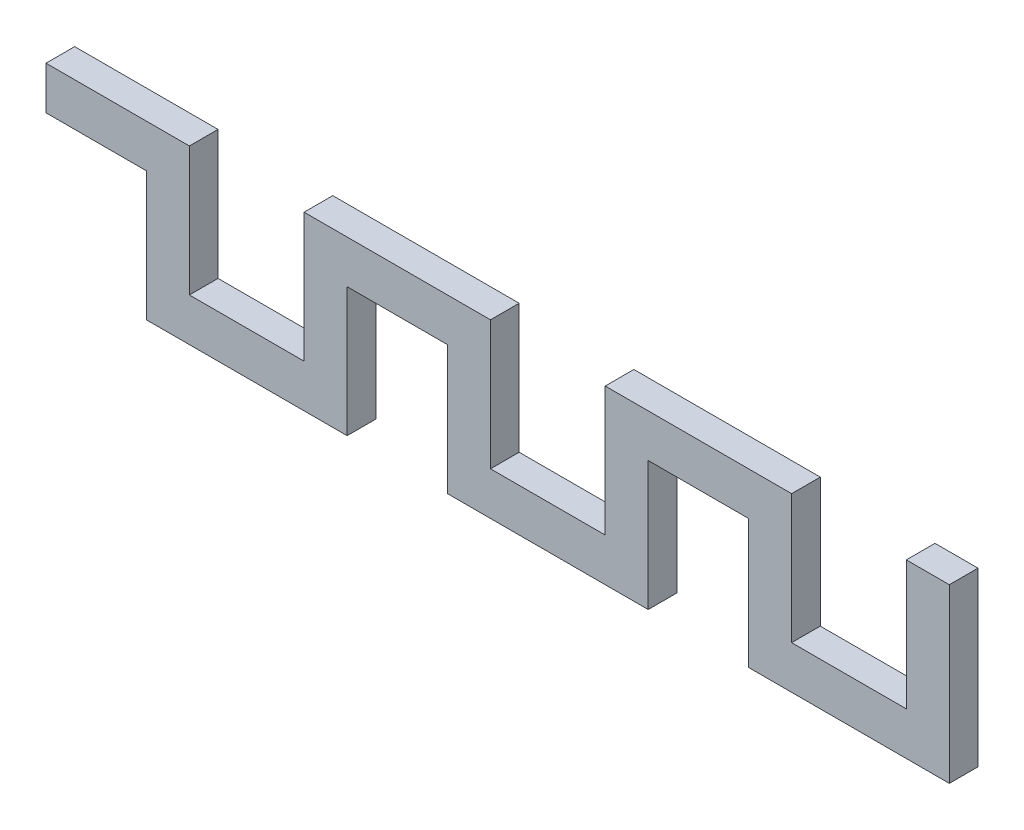
ISO-10303-21;
HEADER;
FILE_DESCRIPTION(('STEP AP214'),'2;1');
FILE_NAME('part.step','',(''),(''),'','','');
FILE_SCHEMA(('AUTOMOTIVE_DESIGN { 1 0 10303 214 1 1 1 1 }'));
ENDSEC;
DATA;
#1=APPLICATION_CONTEXT('core data for automotive mechanical design processes');
#2=APPLICATION_PROTOCOL_DEFINITION('international standard','automotive_design',2000,#1);
#3=PRODUCT_CONTEXT('',#1,'mechanical');
#4=PRODUCT('Part','Part','',(#3));
#5=PRODUCT_RELATED_PRODUCT_CATEGORY('part','',(#4));
#6=PRODUCT_DEFINITION_FORMATION('','',#4);
#7=PRODUCT_DEFINITION_CONTEXT('part definition',#1,'design');
#8=PRODUCT_DEFINITION('design','',#6,#7);
#9=PRODUCT_DEFINITION_SHAPE('','',#8);
#10=(LENGTH_UNIT() NAMED_UNIT(*) SI_UNIT(.MILLI.,.METRE.));
#11=(NAMED_UNIT(*) PLANE_ANGLE_UNIT() SI_UNIT($,.RADIAN.));
#12=(NAMED_UNIT(*) SI_UNIT($,.STERADIAN.) SOLID_ANGLE_UNIT());
#13=UNCERTAINTY_MEASURE_WITH_UNIT(LENGTH_MEASURE(1.E-05),#10,'distance_accuracy_value','');
#14=(GEOMETRIC_REPRESENTATION_CONTEXT(3) GLOBAL_UNCERTAINTY_ASSIGNED_CONTEXT((#13)) GLOBAL_UNIT_ASSIGNED_CONTEXT((#10,
#11,#12)) REPRESENTATION_CONTEXT('',''));
#15=CARTESIAN_POINT('',(0.,0.,0.));
#16=DIRECTION('',(0.,0.,1.));
#17=DIRECTION('',(1.,0.,0.));
#18=AXIS2_PLACEMENT_3D('',#15,#16,#17);
#19=CARTESIAN_POINT('',(0.,0.,4.));
#20=DIRECTION('',(1.,0.,0.));
#21=DIRECTION('',(0.,0.,-1.));
#22=AXIS2_PLACEMENT_3D('',#19,#20,#21);
#23=PLANE('',#22);
#24=DIRECTION('',(0.,-1.,0.));
#25=VECTOR('',#24,1.);
#26=CARTESIAN_POINT('',(0.,0.,0.));
#27=LINE('',#26,#25);
#28=CARTESIAN_POINT('',(0.,0.,0.));
#29=VERTEX_POINT('',#28);
#30=CARTESIAN_POINT('',(0.,-6.,0.));
#31=VERTEX_POINT('',#30);
#32=EDGE_CURVE('E248',#29,#31,#27,.T.);
#33=ORIENTED_EDGE('',*,*,#32,.T.);
#34=DIRECTION('',(0.,0.,-1.));
#35=VECTOR('',#34,1.);
#36=CARTESIAN_POINT('',(0.,-6.,4.));
#37=LINE('',#36,#35);
#38=CARTESIAN_POINT('',(0.,-6.,4.));
#39=VERTEX_POINT('',#38);
#40=EDGE_CURVE('E11',#39,#31,#37,.T.);
#41=ORIENTED_EDGE('',*,*,#40,.F.);
#42=DIRECTION('',(0.,-1.,0.));
#43=VECTOR('',#42,1.);
#44=CARTESIAN_POINT('',(0.,0.,4.));
#45=LINE('',#44,#43);
#46=CARTESIAN_POINT('',(0.,0.,4.));
#47=VERTEX_POINT('',#46);
#48=EDGE_CURVE('E299',#47,#39,#45,.T.);
#49=ORIENTED_EDGE('',*,*,#48,.F.);
#50=DIRECTION('',(0.,0.,-1.));
#51=VECTOR('',#50,1.);
#52=CARTESIAN_POINT('',(0.,0.,4.));
#53=LINE('',#52,#51);
#54=EDGE_CURVE('E244',#47,#29,#53,.T.);
#55=ORIENTED_EDGE('',*,*,#54,.T.);
#56=EDGE_LOOP('',(#33,#41,#49,#55));
#57=FACE_BOUND('',#56,.T.);
#58=ADVANCED_FACE('F43',(#57),#23,.F.);
#59=CARTESIAN_POINT('',(0.,-6.,4.));
#60=DIRECTION('',(0.,1.,0.));
#61=DIRECTION('',(0.,0.,1.));
#62=AXIS2_PLACEMENT_3D('',#59,#60,#61);
#63=PLANE('',#62);
#64=DIRECTION('',(1.,0.,0.));
#65=VECTOR('',#64,1.);
#66=CARTESIAN_POINT('',(0.,-6.,0.));
#67=LINE('',#66,#65);
#68=CARTESIAN_POINT('',(14.,-6.,0.));
#69=VERTEX_POINT('',#68);
#70=EDGE_CURVE('E251',#31,#69,#67,.T.);
#71=ORIENTED_EDGE('',*,*,#70,.T.);
#72=DIRECTION('',(0.,0.,-1.));
#73=VECTOR('',#72,1.);
#74=CARTESIAN_POINT('',(14.,-6.,4.));
#75=LINE('',#74,#73);
#76=CARTESIAN_POINT('',(14.,-6.,4.));
#77=VERTEX_POINT('',#76);
#78=EDGE_CURVE('E52',#77,#69,#75,.T.);
#79=ORIENTED_EDGE('',*,*,#78,.F.);
#80=DIRECTION('',(1.,0.,0.));
#81=VECTOR('',#80,1.);
#82=CARTESIAN_POINT('',(0.,-6.,4.));
#83=LINE('',#82,#81);
#84=EDGE_CURVE('E157',#39,#77,#83,.T.);
#85=ORIENTED_EDGE('',*,*,#84,.F.);
#86=ORIENTED_EDGE('',*,*,#40,.T.);
#87=EDGE_LOOP('',(#71,#79,#85,#86));
#88=FACE_BOUND('',#87,.T.);
#89=ADVANCED_FACE('F447',(#88),#63,.F.);
#90=CARTESIAN_POINT('',(14.,-6.,4.));
#91=DIRECTION('',(1.,0.,0.));
#92=DIRECTION('',(0.,0.,-1.));
#93=AXIS2_PLACEMENT_3D('',#90,#91,#92);
#94=PLANE('',#93);
#95=DIRECTION('',(0.,-1.,0.));
#96=VECTOR('',#95,1.);
#97=CARTESIAN_POINT('',(14.,-6.,0.));
#98=LINE('',#97,#96);
#99=CARTESIAN_POINT('',(14.,-24.,0.));
#100=VERTEX_POINT('',#99);
#101=EDGE_CURVE('E253',#69,#100,#98,.T.);
#102=ORIENTED_EDGE('',*,*,#101,.T.);
#103=DIRECTION('',(0.,0.,-1.));
#104=VECTOR('',#103,1.);
#105=CARTESIAN_POINT('',(14.,-24.,4.));
#106=LINE('',#105,#104);
#107=CARTESIAN_POINT('',(14.,-24.,4.));
#108=VERTEX_POINT('',#107);
#109=EDGE_CURVE('E360',#108,#100,#106,.T.);
#110=ORIENTED_EDGE('',*,*,#109,.F.);
#111=DIRECTION('',(0.,-1.,0.));
#112=VECTOR('',#111,1.);
#113=CARTESIAN_POINT('',(14.,-6.,4.));
#114=LINE('',#113,#112);
#115=EDGE_CURVE('E368',#77,#108,#114,.T.);
#116=ORIENTED_EDGE('',*,*,#115,.F.);
#117=ORIENTED_EDGE('',*,*,#78,.T.);
#118=EDGE_LOOP('',(#102,#110,#116,#117));
#119=FACE_BOUND('',#118,.T.);
#120=ADVANCED_FACE('F366',(#119),#94,.F.);
#121=CARTESIAN_POINT('',(14.,-24.,4.));
#122=DIRECTION('',(0.,1.,0.));
#123=DIRECTION('',(0.,0.,1.));
#124=AXIS2_PLACEMENT_3D('',#121,#122,#123);
#125=PLANE('',#124);
#126=DIRECTION('',(1.,0.,0.));
#127=VECTOR('',#126,1.);
#128=CARTESIAN_POINT('',(14.,-24.,0.));
#129=LINE('',#128,#127);
#130=CARTESIAN_POINT('',(42.,-24.,0.));
#131=VERTEX_POINT('',#130);
#132=EDGE_CURVE('E255',#100,#131,#129,.T.);
#133=ORIENTED_EDGE('',*,*,#132,.T.);
#134=DIRECTION('',(0.,0.,-1.));
#135=VECTOR('',#134,1.);
#136=CARTESIAN_POINT('',(42.,-24.,4.));
#137=LINE('',#136,#135);
#138=CARTESIAN_POINT('',(42.,-24.,4.));
#139=VERTEX_POINT('',#138);
#140=EDGE_CURVE('E357',#139,#131,#137,.T.);
#141=ORIENTED_EDGE('',*,*,#140,.F.);
#142=DIRECTION('',(1.,0.,0.));
#143=VECTOR('',#142,1.);
#144=CARTESIAN_POINT('',(14.,-24.,4.));
#145=LINE('',#144,#143);
#146=EDGE_CURVE('E386',#108,#139,#145,.T.);
#147=ORIENTED_EDGE('',*,*,#146,.F.);
#148=ORIENTED_EDGE('',*,*,#109,.T.);
#149=EDGE_LOOP('',(#133,#141,#147,#148));
#150=FACE_BOUND('',#149,.T.);
#151=ADVANCED_FACE('F377',(#150),#125,.F.);
#152=CARTESIAN_POINT('',(42.,-24.,4.));
#153=DIRECTION('',(-1.,0.,0.));
#154=DIRECTION('',(0.,0.,1.));
#155=AXIS2_PLACEMENT_3D('',#152,#153,#154);
#156=PLANE('',#155);
#157=DIRECTION('',(0.,1.,0.));
#158=VECTOR('',#157,1.);
#159=CARTESIAN_POINT('',(42.,-24.,0.));
#160=LINE('',#159,#158);
#161=CARTESIAN_POINT('',(42.,-6.,0.));
#162=VERTEX_POINT('',#161);
#163=EDGE_CURVE('E257',#131,#162,#160,.T.);
#164=ORIENTED_EDGE('',*,*,#163,.T.);
#165=DIRECTION('',(0.,0.,-1.));
#166=VECTOR('',#165,1.);
#167=CARTESIAN_POINT('',(42.,-6.,4.));
#168=LINE('',#167,#166);
#169=CARTESIAN_POINT('',(42.,-6.,4.));
#170=VERTEX_POINT('',#169);
#171=EDGE_CURVE('E354',#170,#162,#168,.T.);
#172=ORIENTED_EDGE('',*,*,#171,.F.);
#173=DIRECTION('',(0.,1.,0.));
#174=VECTOR('',#173,1.);
#175=CARTESIAN_POINT('',(42.,-24.,4.));
#176=LINE('',#175,#174);
#177=EDGE_CURVE('E383',#139,#170,#176,.T.);
#178=ORIENTED_EDGE('',*,*,#177,.F.);
#179=ORIENTED_EDGE('',*,*,#140,.T.);
#180=EDGE_LOOP('',(#164,#172,#178,#179));
#181=FACE_BOUND('',#180,.T.);
#182=ADVANCED_FACE('F381',(#181),#156,.F.);
#183=CARTESIAN_POINT('',(42.,-6.,4.));
#184=DIRECTION('',(0.,1.,0.));
#185=DIRECTION('',(0.,0.,1.));
#186=AXIS2_PLACEMENT_3D('',#183,#184,#185);
#187=PLANE('',#186);
#188=DIRECTION('',(1.,0.,0.));
#189=VECTOR('',#188,1.);
#190=CARTESIAN_POINT('',(42.,-6.,0.));
#191=LINE('',#190,#189);
#192=CARTESIAN_POINT('',(56.,-6.,0.));
#193=VERTEX_POINT('',#192);
#194=EDGE_CURVE('E259',#162,#193,#191,.T.);
#195=ORIENTED_EDGE('',*,*,#194,.T.);
#196=DIRECTION('',(0.,0.,-1.));
#197=VECTOR('',#196,1.);
#198=CARTESIAN_POINT('',(56.,-6.,4.));
#199=LINE('',#198,#197);
#200=CARTESIAN_POINT('',(56.,-6.,4.));
#201=VERTEX_POINT('',#200);
#202=EDGE_CURVE('E351',#201,#193,#199,.T.);
#203=ORIENTED_EDGE('',*,*,#202,.F.);
#204=DIRECTION('',(1.,0.,0.));
#205=VECTOR('',#204,1.);
#206=CARTESIAN_POINT('',(42.,-6.,4.));
#207=LINE('',#206,#205);
#208=EDGE_CURVE('E385',#170,#201,#207,.T.);
#209=ORIENTED_EDGE('',*,*,#208,.F.);
#210=ORIENTED_EDGE('',*,*,#171,.T.);
#211=EDGE_LOOP('',(#195,#203,#209,#210));
#212=FACE_BOUND('',#211,.T.);
#213=ADVANCED_FACE('F460',(#212),#187,.F.);
#214=CARTESIAN_POINT('',(56.,-6.,4.));
#215=DIRECTION('',(1.,0.,0.));
#216=DIRECTION('',(0.,0.,-1.));
#217=AXIS2_PLACEMENT_3D('',#214,#215,#216);
#218=PLANE('',#217);
#219=DIRECTION('',(0.,-1.,0.));
#220=VECTOR('',#219,1.);
#221=CARTESIAN_POINT('',(56.,-6.,0.));
#222=LINE('',#221,#220);
#223=CARTESIAN_POINT('',(56.,-24.,0.));
#224=VERTEX_POINT('',#223);
#225=EDGE_CURVE('E261',#193,#224,#222,.T.);
#226=ORIENTED_EDGE('',*,*,#225,.T.);
#227=DIRECTION('',(0.,0.,-1.));
#228=VECTOR('',#227,1.);
#229=CARTESIAN_POINT('',(56.,-24.,4.));
#230=LINE('',#229,#228);
#231=CARTESIAN_POINT('',(56.,-24.,4.));
#232=VERTEX_POINT('',#231);
#233=EDGE_CURVE('E348',#232,#224,#230,.T.);
#234=ORIENTED_EDGE('',*,*,#233,.F.);
#235=DIRECTION('',(0.,-1.,0.));
#236=VECTOR('',#235,1.);
#237=CARTESIAN_POINT('',(56.,-6.,4.));
#238=LINE('',#237,#236);
#239=EDGE_CURVE('E388',#201,#232,#238,.T.);
#240=ORIENTED_EDGE('',*,*,#239,.F.);
#241=ORIENTED_EDGE('',*,*,#202,.T.);
#242=EDGE_LOOP('',(#226,#234,#240,#241));
#243=FACE_BOUND('',#242,.T.);
#244=ADVANCED_FACE('F463',(#243),#218,.F.);
#245=CARTESIAN_POINT('',(56.,-24.,4.));
#246=DIRECTION('',(0.,1.,0.));
#247=DIRECTION('',(0.,0.,1.));
#248=AXIS2_PLACEMENT_3D('',#245,#246,#247);
#249=PLANE('',#248);
#250=DIRECTION('',(1.,0.,0.));
#251=VECTOR('',#250,1.);
#252=CARTESIAN_POINT('',(56.,-24.,0.));
#253=LINE('',#252,#251);
#254=CARTESIAN_POINT('',(84.,-24.,0.));
#255=VERTEX_POINT('',#254);
#256=EDGE_CURVE('E263',#224,#255,#253,.T.);
#257=ORIENTED_EDGE('',*,*,#256,.T.);
#258=DIRECTION('',(0.,0.,-1.));
#259=VECTOR('',#258,1.);
#260=CARTESIAN_POINT('',(84.,-24.,4.));
#261=LINE('',#260,#259);
#262=CARTESIAN_POINT('',(84.,-24.,4.));
#263=VERTEX_POINT('',#262);
#264=EDGE_CURVE('E345',#263,#255,#261,.T.);
#265=ORIENTED_EDGE('',*,*,#264,.F.);
#266=DIRECTION('',(1.,0.,0.));
#267=VECTOR('',#266,1.);
#268=CARTESIAN_POINT('',(56.,-24.,4.));
#269=LINE('',#268,#267);
#270=EDGE_CURVE('E394',#232,#263,#269,.T.);
#271=ORIENTED_EDGE('',*,*,#270,.F.);
#272=ORIENTED_EDGE('',*,*,#233,.T.);
#273=EDGE_LOOP('',(#257,#265,#271,#272));
#274=FACE_BOUND('',#273,.T.);
#275=ADVANCED_FACE('F467',(#274),#249,.F.);
#276=CARTESIAN_POINT('',(84.,-24.,4.));
#277=DIRECTION('',(-1.,0.,0.));
#278=DIRECTION('',(0.,0.,1.));
#279=AXIS2_PLACEMENT_3D('',#276,#277,#278);
#280=PLANE('',#279);
#281=DIRECTION('',(0.,1.,0.));
#282=VECTOR('',#281,1.);
#283=CARTESIAN_POINT('',(84.,-24.,0.));
#284=LINE('',#283,#282);
#285=CARTESIAN_POINT('',(84.,-6.,0.));
#286=VERTEX_POINT('',#285);
#287=EDGE_CURVE('E265',#255,#286,#284,.T.);
#288=ORIENTED_EDGE('',*,*,#287,.T.);
#289=DIRECTION('',(0.,0.,-1.));
#290=VECTOR('',#289,1.);
#291=CARTESIAN_POINT('',(84.,-6.,4.));
#292=LINE('',#291,#290);
#293=CARTESIAN_POINT('',(84.,-6.,4.));
#294=VERTEX_POINT('',#293);
#295=EDGE_CURVE('E342',#294,#286,#292,.T.);
#296=ORIENTED_EDGE('',*,*,#295,.F.);
#297=DIRECTION('',(0.,1.,0.));
#298=VECTOR('',#297,1.);
#299=CARTESIAN_POINT('',(84.,-24.,4.));
#300=LINE('',#299,#298);
#301=EDGE_CURVE('E396',#263,#294,#300,.T.);
#302=ORIENTED_EDGE('',*,*,#301,.F.);
#303=ORIENTED_EDGE('',*,*,#264,.T.);
#304=EDGE_LOOP('',(#288,#296,#302,#303));
#305=FACE_BOUND('',#304,.T.);
#306=ADVANCED_FACE('F471',(#305),#280,.F.);
#307=CARTESIAN_POINT('',(84.,-6.,4.));
#308=DIRECTION('',(0.,1.,0.));
#309=DIRECTION('',(0.,0.,1.));
#310=AXIS2_PLACEMENT_3D('',#307,#308,#309);
#311=PLANE('',#310);
#312=DIRECTION('',(1.,0.,0.));
#313=VECTOR('',#312,1.);
#314=CARTESIAN_POINT('',(84.,-6.,0.));
#315=LINE('',#314,#313);
#316=CARTESIAN_POINT('',(98.,-6.,0.));
#317=VERTEX_POINT('',#316);
#318=EDGE_CURVE('E267',#286,#317,#315,.T.);
#319=ORIENTED_EDGE('',*,*,#318,.T.);
#320=DIRECTION('',(0.,0.,-1.));
#321=VECTOR('',#320,1.);
#322=CARTESIAN_POINT('',(98.,-6.,4.));
#323=LINE('',#322,#321);
#324=CARTESIAN_POINT('',(98.,-6.,4.));
#325=VERTEX_POINT('',#324);
#326=EDGE_CURVE('E339',#325,#317,#323,.T.);
#327=ORIENTED_EDGE('',*,*,#326,.F.);
#328=DIRECTION('',(1.,0.,0.));
#329=VECTOR('',#328,1.);
#330=CARTESIAN_POINT('',(84.,-6.,4.));
#331=LINE('',#330,#329);
#332=EDGE_CURVE('E398',#294,#325,#331,.T.);
#333=ORIENTED_EDGE('',*,*,#332,.F.);
#334=ORIENTED_EDGE('',*,*,#295,.T.);
#335=EDGE_LOOP('',(#319,#327,#333,#334));
#336=FACE_BOUND('',#335,.T.);
#337=ADVANCED_FACE('F475',(#336),#311,.F.);
#338=CARTESIAN_POINT('',(98.,-6.,4.));
#339=DIRECTION('',(1.,0.,0.));
#340=DIRECTION('',(0.,0.,-1.));
#341=AXIS2_PLACEMENT_3D('',#338,#339,#340);
#342=PLANE('',#341);
#343=DIRECTION('',(0.,-1.,0.));
#344=VECTOR('',#343,1.);
#345=CARTESIAN_POINT('',(98.,-6.,0.));
#346=LINE('',#345,#344);
#347=CARTESIAN_POINT('',(98.,-24.,0.));
#348=VERTEX_POINT('',#347);
#349=EDGE_CURVE('E269',#317,#348,#346,.T.);
#350=ORIENTED_EDGE('',*,*,#349,.T.);
#351=DIRECTION('',(0.,0.,-1.));
#352=VECTOR('',#351,1.);
#353=CARTESIAN_POINT('',(98.,-24.,4.));
#354=LINE('',#353,#352);
#355=CARTESIAN_POINT('',(98.,-24.,4.));
#356=VERTEX_POINT('',#355);
#357=EDGE_CURVE('E336',#356,#348,#354,.T.);
#358=ORIENTED_EDGE('',*,*,#357,.F.);
#359=DIRECTION('',(0.,-1.,0.));
#360=VECTOR('',#359,1.);
#361=CARTESIAN_POINT('',(98.,-6.,4.));
#362=LINE('',#361,#360);
#363=EDGE_CURVE('E400',#325,#356,#362,.T.);
#364=ORIENTED_EDGE('',*,*,#363,.F.);
#365=ORIENTED_EDGE('',*,*,#326,.T.);
#366=EDGE_LOOP('',(#350,#358,#364,#365));
#367=FACE_BOUND('',#366,.T.);
#368=ADVANCED_FACE('F479',(#367),#342,.F.);
#369=CARTESIAN_POINT('',(98.,-24.,4.));
#370=DIRECTION('',(0.,1.,0.));
#371=DIRECTION('',(0.,0.,1.));
#372=AXIS2_PLACEMENT_3D('',#369,#370,#371);
#373=PLANE('',#372);
#374=DIRECTION('',(1.,0.,0.));
#375=VECTOR('',#374,1.);
#376=CARTESIAN_POINT('',(98.,-24.,0.));
#377=LINE('',#376,#375);
#378=CARTESIAN_POINT('',(126.,-24.,0.));
#379=VERTEX_POINT('',#378);
#380=EDGE_CURVE('E271',#348,#379,#377,.T.);
#381=ORIENTED_EDGE('',*,*,#380,.T.);
#382=DIRECTION('',(0.,0.,-1.));
#383=VECTOR('',#382,1.);
#384=CARTESIAN_POINT('',(126.,-24.,4.));
#385=LINE('',#384,#383);
#386=CARTESIAN_POINT('',(126.,-24.,4.));
#387=VERTEX_POINT('',#386);
#388=EDGE_CURVE('E333',#387,#379,#385,.T.);
#389=ORIENTED_EDGE('',*,*,#388,.F.);
#390=DIRECTION('',(1.,0.,0.));
#391=VECTOR('',#390,1.);
#392=CARTESIAN_POINT('',(98.,-24.,4.));
#393=LINE('',#392,#391);
#394=EDGE_CURVE('E402',#356,#387,#393,.T.);
#395=ORIENTED_EDGE('',*,*,#394,.F.);
#396=ORIENTED_EDGE('',*,*,#357,.T.);
#397=EDGE_LOOP('',(#381,#389,#395,#396));
#398=FACE_BOUND('',#397,.T.);
#399=ADVANCED_FACE('F483',(#398),#373,.F.);
#400=CARTESIAN_POINT('',(126.,-6.,4.));
#401=DIRECTION('',(-1.,0.,0.));
#402=DIRECTION('',(0.,0.,1.));
#403=AXIS2_PLACEMENT_3D('',#400,#401,#402);
#404=PLANE('',#403);
#405=DIRECTION('',(0.,1.,0.));
#406=VECTOR('',#405,1.);
#407=CARTESIAN_POINT('',(126.,-6.,0.));
#408=LINE('',#407,#406);
#409=CARTESIAN_POINT('',(126.,0.,0.));
#410=VERTEX_POINT('',#409);
#411=EDGE_CURVE('E274',#379,#410,#408,.T.);
#412=ORIENTED_EDGE('',*,*,#411,.T.);
#413=DIRECTION('',(0.,0.,-1.));
#414=VECTOR('',#413,1.);
#415=CARTESIAN_POINT('',(126.,0.,4.));
#416=LINE('',#415,#414);
#417=CARTESIAN_POINT('',(126.,0.,4.));
#418=VERTEX_POINT('',#417);
#419=EDGE_CURVE('E330',#418,#410,#416,.T.);
#420=ORIENTED_EDGE('',*,*,#419,.F.);
#421=DIRECTION('',(0.,1.,0.));
#422=VECTOR('',#421,1.);
#423=CARTESIAN_POINT('',(126.,-24.,4.));
#424=LINE('',#423,#422);
#425=EDGE_CURVE('E404',#387,#418,#424,.T.);
#426=ORIENTED_EDGE('',*,*,#425,.F.);
#427=ORIENTED_EDGE('',*,*,#388,.T.);
#428=EDGE_LOOP('',(#412,#420,#426,#427));
#429=FACE_BOUND('',#428,.T.);
#430=ADVANCED_FACE('F487',(#429),#404,.F.);
#431=CARTESIAN_POINT('',(126.,0.,4.));
#432=DIRECTION('',(0.,-1.,0.));
#433=DIRECTION('',(0.,0.,-1.));
#434=AXIS2_PLACEMENT_3D('',#431,#432,#433);
#435=PLANE('',#434);
#436=DIRECTION('',(-1.,0.,0.));
#437=VECTOR('',#436,1.);
#438=CARTESIAN_POINT('',(126.,0.,0.));
#439=LINE('',#438,#437);
#440=CARTESIAN_POINT('',(120.,0.,0.));
#441=VERTEX_POINT('',#440);
#442=EDGE_CURVE('E276',#410,#441,#439,.T.);
#443=ORIENTED_EDGE('',*,*,#442,.T.);
#444=DIRECTION('',(0.,0.,-1.));
#445=VECTOR('',#444,1.);
#446=CARTESIAN_POINT('',(120.,0.,4.));
#447=LINE('',#446,#445);
#448=CARTESIAN_POINT('',(120.,0.,4.));
#449=VERTEX_POINT('',#448);
#450=EDGE_CURVE('E327',#449,#441,#447,.T.);
#451=ORIENTED_EDGE('',*,*,#450,.F.);
#452=DIRECTION('',(-1.,0.,0.));
#453=VECTOR('',#452,1.);
#454=CARTESIAN_POINT('',(126.,0.,4.));
#455=LINE('',#454,#453);
#456=EDGE_CURVE('E406',#418,#449,#455,.T.);
#457=ORIENTED_EDGE('',*,*,#456,.F.);
#458=ORIENTED_EDGE('',*,*,#419,.T.);
#459=EDGE_LOOP('',(#443,#451,#457,#458));
#460=FACE_BOUND('',#459,.T.);
#461=ADVANCED_FACE('F491',(#460),#435,.F.);
#462=CARTESIAN_POINT('',(120.,-18.,4.));
#463=DIRECTION('',(1.,0.,0.));
#464=DIRECTION('',(0.,0.,-1.));
#465=AXIS2_PLACEMENT_3D('',#462,#463,#464);
#466=PLANE('',#465);
#467=DIRECTION('',(0.,-1.,0.));
#468=VECTOR('',#467,1.);
#469=CARTESIAN_POINT('',(120.,-18.,0.));
#470=LINE('',#469,#468);
#471=CARTESIAN_POINT('',(120.,-18.,0.));
#472=VERTEX_POINT('',#471);
#473=EDGE_CURVE('E278',#441,#472,#470,.T.);
#474=ORIENTED_EDGE('',*,*,#473,.T.);
#475=DIRECTION('',(0.,0.,-1.));
#476=VECTOR('',#475,1.);
#477=CARTESIAN_POINT('',(120.,-18.,4.));
#478=LINE('',#477,#476);
#479=CARTESIAN_POINT('',(120.,-18.,4.));
#480=VERTEX_POINT('',#479);
#481=EDGE_CURVE('E324',#480,#472,#478,.T.);
#482=ORIENTED_EDGE('',*,*,#481,.F.);
#483=DIRECTION('',(0.,-1.,0.));
#484=VECTOR('',#483,1.);
#485=CARTESIAN_POINT('',(120.,-18.,4.));
#486=LINE('',#485,#484);
#487=EDGE_CURVE('E408',#449,#480,#486,.T.);
#488=ORIENTED_EDGE('',*,*,#487,.F.);
#489=ORIENTED_EDGE('',*,*,#450,.T.);
#490=EDGE_LOOP('',(#474,#482,#488,#489));
#491=FACE_BOUND('',#490,.T.);
#492=ADVANCED_FACE('F495',(#491),#466,.F.);
#493=CARTESIAN_POINT('',(104.,-18.,4.));
#494=DIRECTION('',(0.,-1.,0.));
#495=DIRECTION('',(0.,0.,-1.));
#496=AXIS2_PLACEMENT_3D('',#493,#494,#495);
#497=PLANE('',#496);
#498=DIRECTION('',(-1.,0.,0.));
#499=VECTOR('',#498,1.);
#500=CARTESIAN_POINT('',(104.,-18.,0.));
#501=LINE('',#500,#499);
#502=CARTESIAN_POINT('',(104.,-18.,0.));
#503=VERTEX_POINT('',#502);
#504=EDGE_CURVE('E280',#472,#503,#501,.T.);
#505=ORIENTED_EDGE('',*,*,#504,.T.);
#506=DIRECTION('',(0.,0.,-1.));
#507=VECTOR('',#506,1.);
#508=CARTESIAN_POINT('',(104.,-18.,4.));
#509=LINE('',#508,#507);
#510=CARTESIAN_POINT('',(104.,-18.,4.));
#511=VERTEX_POINT('',#510);
#512=EDGE_CURVE('E321',#511,#503,#509,.T.);
#513=ORIENTED_EDGE('',*,*,#512,.F.);
#514=DIRECTION('',(-1.,0.,0.));
#515=VECTOR('',#514,1.);
#516=CARTESIAN_POINT('',(104.,-18.,4.));
#517=LINE('',#516,#515);
#518=EDGE_CURVE('E410',#480,#511,#517,.T.);
#519=ORIENTED_EDGE('',*,*,#518,.F.);
#520=ORIENTED_EDGE('',*,*,#481,.T.);
#521=EDGE_LOOP('',(#505,#513,#519,#520));
#522=FACE_BOUND('',#521,.T.);
#523=ADVANCED_FACE('F499',(#522),#497,.F.);
#524=CARTESIAN_POINT('',(104.,0.,4.));
#525=DIRECTION('',(-1.,0.,0.));
#526=DIRECTION('',(0.,0.,1.));
#527=AXIS2_PLACEMENT_3D('',#524,#525,#526);
#528=PLANE('',#527);
#529=DIRECTION('',(0.,1.,0.));
#530=VECTOR('',#529,1.);
#531=CARTESIAN_POINT('',(104.,0.,0.));
#532=LINE('',#531,#530);
#533=CARTESIAN_POINT('',(104.,0.,0.));
#534=VERTEX_POINT('',#533);
#535=EDGE_CURVE('E282',#503,#534,#532,.T.);
#536=ORIENTED_EDGE('',*,*,#535,.T.);
#537=DIRECTION('',(0.,0.,-1.));
#538=VECTOR('',#537,1.);
#539=CARTESIAN_POINT('',(104.,0.,4.));
#540=LINE('',#539,#538);
#541=CARTESIAN_POINT('',(104.,0.,4.));
#542=VERTEX_POINT('',#541);
#543=EDGE_CURVE('E318',#542,#534,#540,.T.);
#544=ORIENTED_EDGE('',*,*,#543,.F.);
#545=DIRECTION('',(0.,1.,0.));
#546=VECTOR('',#545,1.);
#547=CARTESIAN_POINT('',(104.,0.,4.));
#548=LINE('',#547,#546);
#549=EDGE_CURVE('E412',#511,#542,#548,.T.);
#550=ORIENTED_EDGE('',*,*,#549,.F.);
#551=ORIENTED_EDGE('',*,*,#512,.T.);
#552=EDGE_LOOP('',(#536,#544,#550,#551));
#553=FACE_BOUND('',#552,.T.);
#554=ADVANCED_FACE('F503',(#553),#528,.F.);
#555=CARTESIAN_POINT('',(78.,0.,4.));
#556=DIRECTION('',(0.,-1.,0.));
#557=DIRECTION('',(0.,0.,-1.));
#558=AXIS2_PLACEMENT_3D('',#555,#556,#557);
#559=PLANE('',#558);
#560=DIRECTION('',(-1.,0.,0.));
#561=VECTOR('',#560,1.);
#562=CARTESIAN_POINT('',(78.,0.,0.));
#563=LINE('',#562,#561);
#564=CARTESIAN_POINT('',(78.,0.,0.));
#565=VERTEX_POINT('',#564);
#566=EDGE_CURVE('E284',#534,#565,#563,.T.);
#567=ORIENTED_EDGE('',*,*,#566,.T.);
#568=DIRECTION('',(0.,0.,-1.));
#569=VECTOR('',#568,1.);
#570=CARTESIAN_POINT('',(78.,0.,4.));
#571=LINE('',#570,#569);
#572=CARTESIAN_POINT('',(78.,0.,4.));
#573=VERTEX_POINT('',#572);
#574=EDGE_CURVE('E315',#573,#565,#571,.T.);
#575=ORIENTED_EDGE('',*,*,#574,.F.);
#576=DIRECTION('',(-1.,0.,0.));
#577=VECTOR('',#576,1.);
#578=CARTESIAN_POINT('',(78.,0.,4.));
#579=LINE('',#578,#577);
#580=EDGE_CURVE('E414',#542,#573,#579,.T.);
#581=ORIENTED_EDGE('',*,*,#580,.F.);
#582=ORIENTED_EDGE('',*,*,#543,.T.);
#583=EDGE_LOOP('',(#567,#575,#581,#582));
#584=FACE_BOUND('',#583,.T.);
#585=ADVANCED_FACE('F507',(#584),#559,.F.);
#586=CARTESIAN_POINT('',(78.,-18.,4.));
#587=DIRECTION('',(1.,0.,0.));
#588=DIRECTION('',(0.,0.,-1.));
#589=AXIS2_PLACEMENT_3D('',#586,#587,#588);
#590=PLANE('',#589);
#591=DIRECTION('',(0.,-1.,0.));
#592=VECTOR('',#591,1.);
#593=CARTESIAN_POINT('',(78.,-18.,0.));
#594=LINE('',#593,#592);
#595=CARTESIAN_POINT('',(78.,-18.,0.));
#596=VERTEX_POINT('',#595);
#597=EDGE_CURVE('E286',#565,#596,#594,.T.);
#598=ORIENTED_EDGE('',*,*,#597,.T.);
#599=DIRECTION('',(0.,0.,-1.));
#600=VECTOR('',#599,1.);
#601=CARTESIAN_POINT('',(78.,-18.,4.));
#602=LINE('',#601,#600);
#603=CARTESIAN_POINT('',(78.,-18.,4.));
#604=VERTEX_POINT('',#603);
#605=EDGE_CURVE('E312',#604,#596,#602,.T.);
#606=ORIENTED_EDGE('',*,*,#605,.F.);
#607=DIRECTION('',(0.,-1.,0.));
#608=VECTOR('',#607,1.);
#609=CARTESIAN_POINT('',(78.,-18.,4.));
#610=LINE('',#609,#608);
#611=EDGE_CURVE('E416',#573,#604,#610,.T.);
#612=ORIENTED_EDGE('',*,*,#611,.F.);
#613=ORIENTED_EDGE('',*,*,#574,.T.);
#614=EDGE_LOOP('',(#598,#606,#612,#613));
#615=FACE_BOUND('',#614,.T.);
#616=ADVANCED_FACE('F511',(#615),#590,.F.);
#617=CARTESIAN_POINT('',(62.,-18.,4.));
#618=DIRECTION('',(0.,-1.,0.));
#619=DIRECTION('',(0.,0.,-1.));
#620=AXIS2_PLACEMENT_3D('',#617,#618,#619);
#621=PLANE('',#620);
#622=DIRECTION('',(-1.,0.,0.));
#623=VECTOR('',#622,1.);
#624=CARTESIAN_POINT('',(62.,-18.,0.));
#625=LINE('',#624,#623);
#626=CARTESIAN_POINT('',(62.,-18.,0.));
#627=VERTEX_POINT('',#626);
#628=EDGE_CURVE('E288',#596,#627,#625,.T.);
#629=ORIENTED_EDGE('',*,*,#628,.T.);
#630=DIRECTION('',(0.,0.,-1.));
#631=VECTOR('',#630,1.);
#632=CARTESIAN_POINT('',(62.,-18.,4.));
#633=LINE('',#632,#631);
#634=CARTESIAN_POINT('',(62.,-18.,4.));
#635=VERTEX_POINT('',#634);
#636=EDGE_CURVE('E309',#635,#627,#633,.T.);
#637=ORIENTED_EDGE('',*,*,#636,.F.);
#638=DIRECTION('',(-1.,0.,0.));
#639=VECTOR('',#638,1.);
#640=CARTESIAN_POINT('',(62.,-18.,4.));
#641=LINE('',#640,#639);
#642=EDGE_CURVE('E418',#604,#635,#641,.T.);
#643=ORIENTED_EDGE('',*,*,#642,.F.);
#644=ORIENTED_EDGE('',*,*,#605,.T.);
#645=EDGE_LOOP('',(#629,#637,#643,#644));
#646=FACE_BOUND('',#645,.T.);
#647=ADVANCED_FACE('F515',(#646),#621,.F.);
#648=CARTESIAN_POINT('',(62.,0.,4.));
#649=DIRECTION('',(-1.,0.,0.));
#650=DIRECTION('',(0.,0.,1.));
#651=AXIS2_PLACEMENT_3D('',#648,#649,#650);
#652=PLANE('',#651);
#653=DIRECTION('',(0.,1.,0.));
#654=VECTOR('',#653,1.);
#655=CARTESIAN_POINT('',(62.,0.,0.));
#656=LINE('',#655,#654);
#657=CARTESIAN_POINT('',(62.,0.,0.));
#658=VERTEX_POINT('',#657);
#659=EDGE_CURVE('E290',#627,#658,#656,.T.);
#660=ORIENTED_EDGE('',*,*,#659,.T.);
#661=DIRECTION('',(0.,0.,-1.));
#662=VECTOR('',#661,1.);
#663=CARTESIAN_POINT('',(62.,0.,4.));
#664=LINE('',#663,#662);
#665=CARTESIAN_POINT('',(62.,0.,4.));
#666=VERTEX_POINT('',#665);
#667=EDGE_CURVE('E306',#666,#658,#664,.T.);
#668=ORIENTED_EDGE('',*,*,#667,.F.);
#669=DIRECTION('',(0.,1.,0.));
#670=VECTOR('',#669,1.);
#671=CARTESIAN_POINT('',(62.,0.,4.));
#672=LINE('',#671,#670);
#673=EDGE_CURVE('E420',#635,#666,#672,.T.);
#674=ORIENTED_EDGE('',*,*,#673,.F.);
#675=ORIENTED_EDGE('',*,*,#636,.T.);
#676=EDGE_LOOP('',(#660,#668,#674,#675));
#677=FACE_BOUND('',#676,.T.);
#678=ADVANCED_FACE('F519',(#677),#652,.F.);
#679=CARTESIAN_POINT('',(36.,0.,4.));
#680=DIRECTION('',(0.,-1.,0.));
#681=DIRECTION('',(0.,0.,-1.));
#682=AXIS2_PLACEMENT_3D('',#679,#680,#681);
#683=PLANE('',#682);
#684=DIRECTION('',(-1.,0.,0.));
#685=VECTOR('',#684,1.);
#686=CARTESIAN_POINT('',(36.,0.,0.));
#687=LINE('',#686,#685);
#688=CARTESIAN_POINT('',(36.,0.,0.));
#689=VERTEX_POINT('',#688);
#690=EDGE_CURVE('E292',#658,#689,#687,.T.);
#691=ORIENTED_EDGE('',*,*,#690,.T.);
#692=DIRECTION('',(0.,0.,-1.));
#693=VECTOR('',#692,1.);
#694=CARTESIAN_POINT('',(36.,0.,4.));
#695=LINE('',#694,#693);
#696=CARTESIAN_POINT('',(36.,0.,4.));
#697=VERTEX_POINT('',#696);
#698=EDGE_CURVE('E303',#697,#689,#695,.T.);
#699=ORIENTED_EDGE('',*,*,#698,.F.);
#700=DIRECTION('',(-1.,0.,0.));
#701=VECTOR('',#700,1.);
#702=CARTESIAN_POINT('',(36.,0.,4.));
#703=LINE('',#702,#701);
#704=EDGE_CURVE('E422',#666,#697,#703,.T.);
#705=ORIENTED_EDGE('',*,*,#704,.F.);
#706=ORIENTED_EDGE('',*,*,#667,.T.);
#707=EDGE_LOOP('',(#691,#699,#705,#706));
#708=FACE_BOUND('',#707,.T.);
#709=ADVANCED_FACE('F428',(#708),#683,.F.);
#710=CARTESIAN_POINT('',(36.,-18.,4.));
#711=DIRECTION('',(1.,0.,0.));
#712=DIRECTION('',(0.,0.,-1.));
#713=AXIS2_PLACEMENT_3D('',#710,#711,#712);
#714=PLANE('',#713);
#715=DIRECTION('',(0.,-1.,0.));
#716=VECTOR('',#715,1.);
#717=CARTESIAN_POINT('',(36.,-18.,0.));
#718=LINE('',#717,#716);
#719=CARTESIAN_POINT('',(36.,-18.,0.));
#720=VERTEX_POINT('',#719);
#721=EDGE_CURVE('E294',#689,#720,#718,.T.);
#722=ORIENTED_EDGE('',*,*,#721,.T.);
#723=DIRECTION('',(0.,0.,-1.));
#724=VECTOR('',#723,1.);
#725=CARTESIAN_POINT('',(36.,-18.,4.));
#726=LINE('',#725,#724);
#727=CARTESIAN_POINT('',(36.,-18.,4.));
#728=VERTEX_POINT('',#727);
#729=EDGE_CURVE('E239',#728,#720,#726,.T.);
#730=ORIENTED_EDGE('',*,*,#729,.F.);
#731=DIRECTION('',(0.,-1.,0.));
#732=VECTOR('',#731,1.);
#733=CARTESIAN_POINT('',(36.,-18.,4.));
#734=LINE('',#733,#732);
#735=EDGE_CURVE('E230',#697,#728,#734,.T.);
#736=ORIENTED_EDGE('',*,*,#735,.F.);
#737=ORIENTED_EDGE('',*,*,#698,.T.);
#738=EDGE_LOOP('',(#722,#730,#736,#737));
#739=FACE_BOUND('',#738,.T.);
#740=ADVANCED_FACE('F432',(#739),#714,.F.);
#741=CARTESIAN_POINT('',(20.,-18.,4.));
#742=DIRECTION('',(0.,-1.,0.));
#743=DIRECTION('',(0.,0.,-1.));
#744=AXIS2_PLACEMENT_3D('',#741,#742,#743);
#745=PLANE('',#744);
#746=DIRECTION('',(-1.,0.,0.));
#747=VECTOR('',#746,1.);
#748=CARTESIAN_POINT('',(20.,-18.,0.));
#749=LINE('',#748,#747);
#750=CARTESIAN_POINT('',(20.,-18.,0.));
#751=VERTEX_POINT('',#750);
#752=EDGE_CURVE('E238',#720,#751,#749,.T.);
#753=ORIENTED_EDGE('',*,*,#752,.T.);
#754=DIRECTION('',(0.,0.,-1.));
#755=VECTOR('',#754,1.);
#756=CARTESIAN_POINT('',(20.,-18.,4.));
#757=LINE('',#756,#755);
#758=CARTESIAN_POINT('',(20.,-18.,4.));
#759=VERTEX_POINT('',#758);
#760=EDGE_CURVE('E235',#759,#751,#757,.T.);
#761=ORIENTED_EDGE('',*,*,#760,.F.);
#762=DIRECTION('',(-1.,0.,0.));
#763=VECTOR('',#762,1.);
#764=CARTESIAN_POINT('',(20.,-18.,4.));
#765=LINE('',#764,#763);
#766=EDGE_CURVE('E224',#728,#759,#765,.T.);
#767=ORIENTED_EDGE('',*,*,#766,.F.);
#768=ORIENTED_EDGE('',*,*,#729,.T.);
#769=EDGE_LOOP('',(#753,#761,#767,#768));
#770=FACE_BOUND('',#769,.T.);
#771=ADVANCED_FACE('F236',(#770),#745,.F.);
#772=CARTESIAN_POINT('',(20.,0.,4.));
#773=DIRECTION('',(-1.,0.,0.));
#774=DIRECTION('',(0.,0.,1.));
#775=AXIS2_PLACEMENT_3D('',#772,#773,#774);
#776=PLANE('',#775);
#777=DIRECTION('',(0.,1.,0.));
#778=VECTOR('',#777,1.);
#779=CARTESIAN_POINT('',(20.,0.,0.));
#780=LINE('',#779,#778);
#781=CARTESIAN_POINT('',(20.,0.,0.));
#782=VERTEX_POINT('',#781);
#783=EDGE_CURVE('E143',#751,#782,#780,.T.);
#784=ORIENTED_EDGE('',*,*,#783,.T.);
#785=DIRECTION('',(0.,0.,-1.));
#786=VECTOR('',#785,1.);
#787=CARTESIAN_POINT('',(20.,0.,4.));
#788=LINE('',#787,#786);
#789=CARTESIAN_POINT('',(20.,0.,4.));
#790=VERTEX_POINT('',#789);
#791=EDGE_CURVE('E240',#790,#782,#788,.T.);
#792=ORIENTED_EDGE('',*,*,#791,.F.);
#793=DIRECTION('',(0.,1.,0.));
#794=VECTOR('',#793,1.);
#795=CARTESIAN_POINT('',(20.,0.,4.));
#796=LINE('',#795,#794);
#797=EDGE_CURVE('E228',#759,#790,#796,.T.);
#798=ORIENTED_EDGE('',*,*,#797,.F.);
#799=ORIENTED_EDGE('',*,*,#760,.T.);
#800=EDGE_LOOP('',(#784,#792,#798,#799));
#801=FACE_BOUND('',#800,.T.);
#802=ADVANCED_FACE('F242',(#801),#776,.F.);
#803=CARTESIAN_POINT('',(0.,0.,4.));
#804=DIRECTION('',(0.,-1.,0.));
#805=DIRECTION('',(0.,0.,-1.));
#806=AXIS2_PLACEMENT_3D('',#803,#804,#805);
#807=PLANE('',#806);
#808=DIRECTION('',(-1.,0.,0.));
#809=VECTOR('',#808,1.);
#810=CARTESIAN_POINT('',(0.,0.,0.));
#811=LINE('',#810,#809);
#812=EDGE_CURVE('E149',#782,#29,#811,.T.);
#813=ORIENTED_EDGE('',*,*,#812,.T.);
#814=ORIENTED_EDGE('',*,*,#54,.F.);
#815=DIRECTION('',(-1.,0.,0.));
#816=VECTOR('',#815,1.);
#817=CARTESIAN_POINT('',(0.,0.,4.));
#818=LINE('',#817,#816);
#819=EDGE_CURVE('E60',#790,#47,#818,.T.);
#820=ORIENTED_EDGE('',*,*,#819,.F.);
#821=ORIENTED_EDGE('',*,*,#791,.T.);
#822=EDGE_LOOP('',(#813,#814,#820,#821));
#823=FACE_BOUND('',#822,.T.);
#824=ADVANCED_FACE('F436',(#823),#807,.F.);
#825=CARTESIAN_POINT('',(0.,0.,4.));
#826=DIRECTION('',(0.,0.,1.));
#827=DIRECTION('',(1.,0.,0.));
#828=AXIS2_PLACEMENT_3D('',#825,#826,#827);
#829=PLANE('',#828);
#830=ORIENTED_EDGE('',*,*,#48,.T.);
#831=ORIENTED_EDGE('',*,*,#84,.T.);
#832=ORIENTED_EDGE('',*,*,#115,.T.);
#833=ORIENTED_EDGE('',*,*,#146,.T.);
#834=ORIENTED_EDGE('',*,*,#177,.T.);
#835=ORIENTED_EDGE('',*,*,#208,.T.);
#836=ORIENTED_EDGE('',*,*,#239,.T.);
#837=ORIENTED_EDGE('',*,*,#270,.T.);
#838=ORIENTED_EDGE('',*,*,#301,.T.);
#839=ORIENTED_EDGE('',*,*,#332,.T.);
#840=ORIENTED_EDGE('',*,*,#363,.T.);
#841=ORIENTED_EDGE('',*,*,#394,.T.);
#842=ORIENTED_EDGE('',*,*,#425,.T.);
#843=ORIENTED_EDGE('',*,*,#456,.T.);
#844=ORIENTED_EDGE('',*,*,#487,.T.);
#845=ORIENTED_EDGE('',*,*,#518,.T.);
#846=ORIENTED_EDGE('',*,*,#549,.T.);
#847=ORIENTED_EDGE('',*,*,#580,.T.);
#848=ORIENTED_EDGE('',*,*,#611,.T.);
#849=ORIENTED_EDGE('',*,*,#642,.T.);
#850=ORIENTED_EDGE('',*,*,#673,.T.);
#851=ORIENTED_EDGE('',*,*,#704,.T.);
#852=ORIENTED_EDGE('',*,*,#735,.T.);
#853=ORIENTED_EDGE('',*,*,#766,.T.);
#854=ORIENTED_EDGE('',*,*,#797,.T.);
#855=ORIENTED_EDGE('',*,*,#819,.T.);
#856=EDGE_LOOP('',(#830,#831,#832,#833,#834,#835,#836,#837,#838,#839,#840,#841,#842,#843,#844,
#845,#846,#847,#848,#849,#850,#851,#852,#853,#854,#855));
#857=FACE_BOUND('',#856,.T.);
#858=ADVANCED_FACE('F226',(#857),#829,.T.);
#859=CARTESIAN_POINT('',(0.,0.,0.));
#860=DIRECTION('',(0.,0.,1.));
#861=DIRECTION('',(1.,0.,0.));
#862=AXIS2_PLACEMENT_3D('',#859,#860,#861);
#863=PLANE('',#862);
#864=ORIENTED_EDGE('',*,*,#32,.F.);
#865=ORIENTED_EDGE('',*,*,#812,.F.);
#866=ORIENTED_EDGE('',*,*,#783,.F.);
#867=ORIENTED_EDGE('',*,*,#752,.F.);
#868=ORIENTED_EDGE('',*,*,#721,.F.);
#869=ORIENTED_EDGE('',*,*,#690,.F.);
#870=ORIENTED_EDGE('',*,*,#659,.F.);
#871=ORIENTED_EDGE('',*,*,#628,.F.);
#872=ORIENTED_EDGE('',*,*,#597,.F.);
#873=ORIENTED_EDGE('',*,*,#566,.F.);
#874=ORIENTED_EDGE('',*,*,#535,.F.);
#875=ORIENTED_EDGE('',*,*,#504,.F.);
#876=ORIENTED_EDGE('',*,*,#473,.F.);
#877=ORIENTED_EDGE('',*,*,#442,.F.);
#878=ORIENTED_EDGE('',*,*,#411,.F.);
#879=ORIENTED_EDGE('',*,*,#380,.F.);
#880=ORIENTED_EDGE('',*,*,#349,.F.);
#881=ORIENTED_EDGE('',*,*,#318,.F.);
#882=ORIENTED_EDGE('',*,*,#287,.F.);
#883=ORIENTED_EDGE('',*,*,#256,.F.);
#884=ORIENTED_EDGE('',*,*,#225,.F.);
#885=ORIENTED_EDGE('',*,*,#194,.F.);
#886=ORIENTED_EDGE('',*,*,#163,.F.);
#887=ORIENTED_EDGE('',*,*,#132,.F.);
#888=ORIENTED_EDGE('',*,*,#101,.F.);
#889=ORIENTED_EDGE('',*,*,#70,.F.);
#890=EDGE_LOOP('',(#864,#865,#866,#867,#868,#869,#870,#871,#872,#873,#874,#875,#876,#877,#878,
#879,#880,#881,#882,#883,#884,#885,#886,#887,#888,#889));
#891=FACE_BOUND('',#890,.T.);
#892=ADVANCED_FACE('F372',(#891),#863,.F.);
#893=CLOSED_SHELL('',(#58,#89,#120,#151,#182,#213,#244,#275,#306,#337,#368,#399,#430,#461,#492,
#523,#554,#585,#616,#647,#678,#709,#740,#771,#802,#824,#858,#892));
#894=MANIFOLD_SOLID_BREP('B2',#893);
#895=ADVANCED_BREP_SHAPE_REPRESENTATION('',(#18,#894),#14);
#896=SHAPE_DEFINITION_REPRESENTATION(#9,#895);
ENDSEC;
END-ISO-10303-21;
